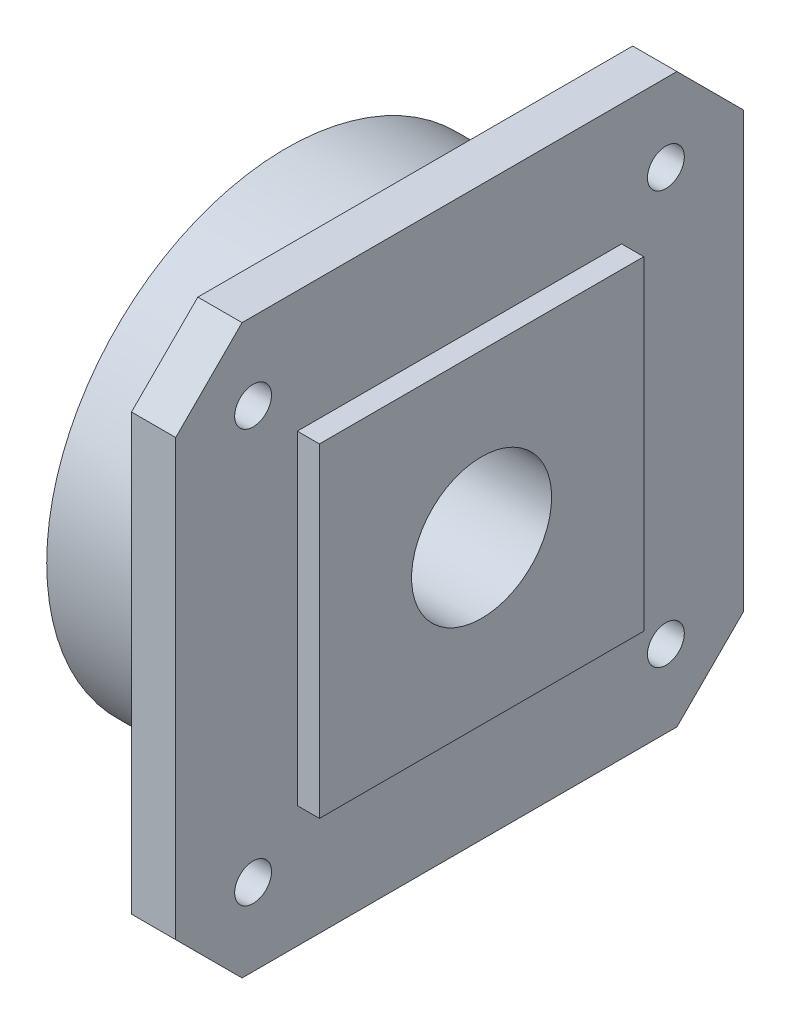
ISO-10303-21;
HEADER;
FILE_DESCRIPTION(('STEP AP214'),'2;1');
FILE_NAME('part.step','',(''),(''),'','','');
FILE_SCHEMA(('AUTOMOTIVE_DESIGN { 1 0 10303 214 1 1 1 1 }'));
ENDSEC;
DATA;
#1=APPLICATION_CONTEXT('core data for automotive mechanical design processes');
#2=APPLICATION_PROTOCOL_DEFINITION('international standard','automotive_design',2000,#1);
#3=PRODUCT_CONTEXT('',#1,'mechanical');
#4=PRODUCT('Part','Part','',(#3));
#5=PRODUCT_RELATED_PRODUCT_CATEGORY('part','',(#4));
#6=PRODUCT_DEFINITION_FORMATION('','',#4);
#7=PRODUCT_DEFINITION_CONTEXT('part definition',#1,'design');
#8=PRODUCT_DEFINITION('design','',#6,#7);
#9=PRODUCT_DEFINITION_SHAPE('','',#8);
#10=(LENGTH_UNIT() NAMED_UNIT(*) SI_UNIT(.MILLI.,.METRE.));
#11=(NAMED_UNIT(*) PLANE_ANGLE_UNIT() SI_UNIT($,.RADIAN.));
#12=(NAMED_UNIT(*) SI_UNIT($,.STERADIAN.) SOLID_ANGLE_UNIT());
#13=UNCERTAINTY_MEASURE_WITH_UNIT(LENGTH_MEASURE(1.E-05),#10,'distance_accuracy_value','');
#14=(GEOMETRIC_REPRESENTATION_CONTEXT(3) GLOBAL_UNCERTAINTY_ASSIGNED_CONTEXT((#13)) GLOBAL_UNIT_ASSIGNED_CONTEXT((#10,
#11,#12)) REPRESENTATION_CONTEXT('',''));
#15=CARTESIAN_POINT('',(0.,0.,0.));
#16=DIRECTION('',(0.,0.,1.));
#17=DIRECTION('',(1.,0.,0.));
#18=AXIS2_PLACEMENT_3D('',#15,#16,#17);
#19=CARTESIAN_POINT('',(-5.5,38.5,-38.5));
#20=DIRECTION('',(-1.,0.,0.));
#21=DIRECTION('',(0.,0.,1.));
#22=AXIS2_PLACEMENT_3D('',#19,#20,#21);
#23=PLANE('',#22);
#24=CARTESIAN_POINT('',(-5.5,38.5,-38.5));
#25=DIRECTION('',(-1.,0.,0.));
#26=DIRECTION('',(0.,0.,1.));
#27=AXIS2_PLACEMENT_3D('',#24,#25,#26);
#28=CIRCLE('',#27,9.5);
#29=CARTESIAN_POINT('',(-5.5,38.5,-29.));
#30=VERTEX_POINT('',#29);
#31=EDGE_CURVE('E36',#30,#30,#28,.F.);
#32=ORIENTED_EDGE('',*,*,#31,.T.);
#33=EDGE_LOOP('',(#32));
#34=FACE_BOUND('',#33,.T.);
#35=CARTESIAN_POINT('',(-5.5,38.5,-38.5));
#36=DIRECTION('',(1.,0.,0.));
#37=DIRECTION('',(0.,0.,-1.));
#38=AXIS2_PLACEMENT_3D('',#35,#36,#37);
#39=CIRCLE('',#38,18.);
#40=CARTESIAN_POINT('',(-5.5,38.5,-56.5));
#41=VERTEX_POINT('',#40);
#42=EDGE_CURVE('E487',#41,#41,#39,.T.);
#43=ORIENTED_EDGE('',*,*,#42,.F.);
#44=EDGE_LOOP('',(#43));
#45=FACE_BOUND('',#44,.T.);
#46=ADVANCED_FACE('F32',(#34,#45),#23,.T.);
#47=CARTESIAN_POINT('',(-17.5,38.5,-38.5));
#48=DIRECTION('',(1.,0.,0.));
#49=DIRECTION('',(0.,0.,-1.));
#50=AXIS2_PLACEMENT_3D('',#47,#48,#49);
#51=CYLINDRICAL_SURFACE('',#50,9.5);
#52=CARTESIAN_POINT('',(9.,38.5,-38.5));
#53=DIRECTION('',(1.,0.,0.));
#54=DIRECTION('',(0.,0.,-1.));
#55=AXIS2_PLACEMENT_3D('',#52,#53,#54);
#56=CIRCLE('',#55,9.5);
#57=CARTESIAN_POINT('',(9.,38.5,-48.));
#58=VERTEX_POINT('',#57);
#59=EDGE_CURVE('E493',#58,#58,#56,.T.);
#60=ORIENTED_EDGE('',*,*,#59,.T.);
#61=EDGE_LOOP('',(#60));
#62=FACE_BOUND('',#61,.T.);
#63=ORIENTED_EDGE('',*,*,#31,.F.);
#64=EDGE_LOOP('',(#63));
#65=FACE_BOUND('',#64,.T.);
#66=ADVANCED_FACE('F252',(#62,#65),#51,.F.);
#67=CARTESIAN_POINT('',(0.,77.,0.));
#68=DIRECTION('',(-1.,0.,0.));
#69=DIRECTION('',(0.,0.,1.));
#70=AXIS2_PLACEMENT_3D('',#67,#68,#69);
#71=PLANE('',#70);
#72=CARTESIAN_POINT('',(0.,10.5,-66.5));
#73=DIRECTION('',(-1.,0.,0.));
#74=DIRECTION('',(0.,0.,1.));
#75=AXIS2_PLACEMENT_3D('',#72,#73,#74);
#76=CIRCLE('',#75,2.5);
#77=CARTESIAN_POINT('',(0.,10.5,-64.));
#78=VERTEX_POINT('',#77);
#79=EDGE_CURVE('E462',#78,#78,#76,.T.);
#80=ORIENTED_EDGE('',*,*,#79,.F.);
#81=EDGE_LOOP('',(#80));
#82=FACE_BOUND('',#81,.T.);
#83=CARTESIAN_POINT('',(0.,10.5,-10.5));
#84=DIRECTION('',(-1.,0.,0.));
#85=DIRECTION('',(0.,0.,1.));
#86=AXIS2_PLACEMENT_3D('',#83,#84,#85);
#87=CIRCLE('',#86,2.5);
#88=CARTESIAN_POINT('',(0.,10.5,-8.));
#89=VERTEX_POINT('',#88);
#90=EDGE_CURVE('E472',#89,#89,#87,.T.);
#91=ORIENTED_EDGE('',*,*,#90,.F.);
#92=EDGE_LOOP('',(#91));
#93=FACE_BOUND('',#92,.T.);
#94=CARTESIAN_POINT('',(0.,66.5,-66.5));
#95=DIRECTION('',(-1.,0.,0.));
#96=DIRECTION('',(0.,0.,1.));
#97=AXIS2_PLACEMENT_3D('',#94,#95,#96);
#98=CIRCLE('',#97,2.5);
#99=CARTESIAN_POINT('',(0.,66.5,-64.));
#100=VERTEX_POINT('',#99);
#101=EDGE_CURVE('E478',#100,#100,#98,.T.);
#102=ORIENTED_EDGE('',*,*,#101,.F.);
#103=EDGE_LOOP('',(#102));
#104=FACE_BOUND('',#103,.T.);
#105=CARTESIAN_POINT('',(0.,66.5,-10.5));
#106=DIRECTION('',(-1.,0.,0.));
#107=DIRECTION('',(0.,0.,1.));
#108=AXIS2_PLACEMENT_3D('',#105,#106,#107);
#109=CIRCLE('',#108,2.5);
#110=CARTESIAN_POINT('',(0.,66.5,-8.));
#111=VERTEX_POINT('',#110);
#112=EDGE_CURVE('E484',#111,#111,#109,.T.);
#113=ORIENTED_EDGE('',*,*,#112,.F.);
#114=EDGE_LOOP('',(#113));
#115=FACE_BOUND('',#114,.T.);
#116=DIRECTION('',(0.,-1.,0.));
#117=VECTOR('',#116,1.);
#118=CARTESIAN_POINT('',(0.,9.,0.));
#119=LINE('',#118,#117);
#120=CARTESIAN_POINT('',(0.,68.,0.));
#121=VERTEX_POINT('',#120);
#122=CARTESIAN_POINT('',(0.,9.,0.));
#123=VERTEX_POINT('',#122);
#124=EDGE_CURVE('E143',#121,#123,#119,.T.);
#125=ORIENTED_EDGE('',*,*,#124,.F.);
#126=DIRECTION('',(0.,-0.707106781186547,0.707106781186548));
#127=VECTOR('',#126,1.);
#128=CARTESIAN_POINT('',(0.,68.,0.));
#129=LINE('',#128,#127);
#130=CARTESIAN_POINT('',(0.,77.,-9.));
#131=VERTEX_POINT('',#130);
#132=EDGE_CURVE('E156',#131,#121,#129,.T.);
#133=ORIENTED_EDGE('',*,*,#132,.F.);
#134=DIRECTION('',(0.,0.,1.));
#135=VECTOR('',#134,1.);
#136=CARTESIAN_POINT('',(0.,77.,-9.));
#137=LINE('',#136,#135);
#138=CARTESIAN_POINT('',(0.,77.,-68.));
#139=VERTEX_POINT('',#138);
#140=EDGE_CURVE('E180',#139,#131,#137,.T.);
#141=ORIENTED_EDGE('',*,*,#140,.F.);
#142=DIRECTION('',(0.,0.707106781186548,0.707106781186548));
#143=VECTOR('',#142,1.);
#144=CARTESIAN_POINT('',(0.,77.,-68.));
#145=LINE('',#144,#143);
#146=CARTESIAN_POINT('',(0.,68.,-77.));
#147=VERTEX_POINT('',#146);
#148=EDGE_CURVE('E178',#147,#139,#145,.T.);
#149=ORIENTED_EDGE('',*,*,#148,.F.);
#150=DIRECTION('',(0.,1.,0.));
#151=VECTOR('',#150,1.);
#152=CARTESIAN_POINT('',(0.,9.,-77.));
#153=LINE('',#152,#151);
#154=CARTESIAN_POINT('',(0.,9.,-77.));
#155=VERTEX_POINT('',#154);
#156=EDGE_CURVE('E176',#155,#147,#153,.T.);
#157=ORIENTED_EDGE('',*,*,#156,.F.);
#158=DIRECTION('',(0.,0.707106781186548,-0.707106781186547));
#159=VECTOR('',#158,1.);
#160=CARTESIAN_POINT('',(0.,0.,-68.));
#161=LINE('',#160,#159);
#162=CARTESIAN_POINT('',(0.,0.,-68.));
#163=VERTEX_POINT('',#162);
#164=EDGE_CURVE('E174',#163,#155,#161,.T.);
#165=ORIENTED_EDGE('',*,*,#164,.F.);
#166=DIRECTION('',(0.,0.,-1.));
#167=VECTOR('',#166,1.);
#168=CARTESIAN_POINT('',(0.,0.,-9.));
#169=LINE('',#168,#167);
#170=CARTESIAN_POINT('',(0.,0.,-9.));
#171=VERTEX_POINT('',#170);
#172=EDGE_CURVE('E172',#171,#163,#169,.T.);
#173=ORIENTED_EDGE('',*,*,#172,.F.);
#174=DIRECTION('',(0.,-0.707106781186547,-0.707106781186547));
#175=VECTOR('',#174,1.);
#176=CARTESIAN_POINT('',(0.,9.,0.));
#177=LINE('',#176,#175);
#178=EDGE_CURVE('E146',#123,#171,#177,.T.);
#179=ORIENTED_EDGE('',*,*,#178,.F.);
#180=EDGE_LOOP('',(#125,#133,#141,#149,#157,#165,#173,#179));
#181=FACE_BOUND('',#180,.T.);
#182=CARTESIAN_POINT('',(0.,38.5,-38.5));
#183=DIRECTION('',(-1.,0.,0.));
#184=DIRECTION('',(0.,0.,1.));
#185=AXIS2_PLACEMENT_3D('',#182,#183,#184);
#186=CIRCLE('',#185,32.5);
#187=CARTESIAN_POINT('',(0.,38.5,-6.00000000000001));
#188=VERTEX_POINT('',#187);
#189=EDGE_CURVE('E496',#188,#188,#186,.T.);
#190=ORIENTED_EDGE('',*,*,#189,.F.);
#191=EDGE_LOOP('',(#190));
#192=FACE_BOUND('',#191,.T.);
#193=ADVANCED_FACE('F211',(#82,#93,#104,#115,#181,#192),#71,.T.);
#194=CARTESIAN_POINT('',(6.,77.,0.));
#195=DIRECTION('',(-1.,0.,0.));
#196=DIRECTION('',(0.,0.,1.));
#197=AXIS2_PLACEMENT_3D('',#194,#195,#196);
#198=PLANE('',#197);
#199=CARTESIAN_POINT('',(6.,10.5,-66.5));
#200=DIRECTION('',(1.,0.,0.));
#201=DIRECTION('',(0.,0.,-1.));
#202=AXIS2_PLACEMENT_3D('',#199,#200,#201);
#203=CIRCLE('',#202,2.5);
#204=CARTESIAN_POINT('',(6.,10.5,-69.));
#205=VERTEX_POINT('',#204);
#206=EDGE_CURVE('E465',#205,#205,#203,.T.);
#207=ORIENTED_EDGE('',*,*,#206,.F.);
#208=EDGE_LOOP('',(#207));
#209=FACE_BOUND('',#208,.T.);
#210=CARTESIAN_POINT('',(6.,10.5,-10.5));
#211=DIRECTION('',(1.,0.,0.));
#212=DIRECTION('',(0.,0.,-1.));
#213=AXIS2_PLACEMENT_3D('',#210,#211,#212);
#214=CIRCLE('',#213,2.5);
#215=CARTESIAN_POINT('',(6.,10.5,-13.));
#216=VERTEX_POINT('',#215);
#217=EDGE_CURVE('E467',#216,#216,#214,.T.);
#218=ORIENTED_EDGE('',*,*,#217,.F.);
#219=EDGE_LOOP('',(#218));
#220=FACE_BOUND('',#219,.T.);
#221=CARTESIAN_POINT('',(6.,66.5,-66.5));
#222=DIRECTION('',(1.,0.,0.));
#223=DIRECTION('',(0.,0.,-1.));
#224=AXIS2_PLACEMENT_3D('',#221,#222,#223);
#225=CIRCLE('',#224,2.5);
#226=CARTESIAN_POINT('',(6.,66.5,-69.));
#227=VERTEX_POINT('',#226);
#228=EDGE_CURVE('E475',#227,#227,#225,.T.);
#229=ORIENTED_EDGE('',*,*,#228,.F.);
#230=EDGE_LOOP('',(#229));
#231=FACE_BOUND('',#230,.T.);
#232=CARTESIAN_POINT('',(6.,66.5,-10.5));
#233=DIRECTION('',(1.,0.,0.));
#234=DIRECTION('',(0.,0.,-1.));
#235=AXIS2_PLACEMENT_3D('',#232,#233,#234);
#236=CIRCLE('',#235,2.5);
#237=CARTESIAN_POINT('',(6.,66.5,-13.));
#238=VERTEX_POINT('',#237);
#239=EDGE_CURVE('E481',#238,#238,#236,.T.);
#240=ORIENTED_EDGE('',*,*,#239,.F.);
#241=EDGE_LOOP('',(#240));
#242=FACE_BOUND('',#241,.T.);
#243=DIRECTION('',(0.,-1.,0.));
#244=VECTOR('',#243,1.);
#245=CARTESIAN_POINT('',(6.,9.,0.));
#246=LINE('',#245,#244);
#247=CARTESIAN_POINT('',(6.,68.,0.));
#248=VERTEX_POINT('',#247);
#249=CARTESIAN_POINT('',(6.,9.,0.));
#250=VERTEX_POINT('',#249);
#251=EDGE_CURVE('E152',#248,#250,#246,.T.);
#252=ORIENTED_EDGE('',*,*,#251,.T.);
#253=DIRECTION('',(0.,-0.707106781186547,-0.707106781186547));
#254=VECTOR('',#253,1.);
#255=CARTESIAN_POINT('',(6.,9.,0.));
#256=LINE('',#255,#254);
#257=CARTESIAN_POINT('',(6.,0.,-9.));
#258=VERTEX_POINT('',#257);
#259=EDGE_CURVE('E155',#250,#258,#256,.T.);
#260=ORIENTED_EDGE('',*,*,#259,.T.);
#261=DIRECTION('',(0.,0.,-1.));
#262=VECTOR('',#261,1.);
#263=CARTESIAN_POINT('',(6.,0.,-9.));
#264=LINE('',#263,#262);
#265=CARTESIAN_POINT('',(6.,0.,-68.));
#266=VERTEX_POINT('',#265);
#267=EDGE_CURVE('E158',#258,#266,#264,.T.);
#268=ORIENTED_EDGE('',*,*,#267,.T.);
#269=DIRECTION('',(0.,0.707106781186548,-0.707106781186547));
#270=VECTOR('',#269,1.);
#271=CARTESIAN_POINT('',(6.,0.,-68.));
#272=LINE('',#271,#270);
#273=CARTESIAN_POINT('',(6.,9.,-77.));
#274=VERTEX_POINT('',#273);
#275=EDGE_CURVE('E160',#266,#274,#272,.T.);
#276=ORIENTED_EDGE('',*,*,#275,.T.);
#277=DIRECTION('',(0.,1.,0.));
#278=VECTOR('',#277,1.);
#279=CARTESIAN_POINT('',(6.,9.,-77.));
#280=LINE('',#279,#278);
#281=CARTESIAN_POINT('',(6.,68.,-77.));
#282=VERTEX_POINT('',#281);
#283=EDGE_CURVE('E162',#274,#282,#280,.T.);
#284=ORIENTED_EDGE('',*,*,#283,.T.);
#285=DIRECTION('',(0.,0.707106781186548,0.707106781186548));
#286=VECTOR('',#285,1.);
#287=CARTESIAN_POINT('',(6.,77.,-68.));
#288=LINE('',#287,#286);
#289=CARTESIAN_POINT('',(6.,77.,-68.));
#290=VERTEX_POINT('',#289);
#291=EDGE_CURVE('E164',#282,#290,#288,.T.);
#292=ORIENTED_EDGE('',*,*,#291,.T.);
#293=DIRECTION('',(0.,0.,1.));
#294=VECTOR('',#293,1.);
#295=CARTESIAN_POINT('',(6.,77.,-9.));
#296=LINE('',#295,#294);
#297=CARTESIAN_POINT('',(6.,77.,-9.));
#298=VERTEX_POINT('',#297);
#299=EDGE_CURVE('E166',#290,#298,#296,.T.);
#300=ORIENTED_EDGE('',*,*,#299,.T.);
#301=DIRECTION('',(0.,-0.707106781186547,0.707106781186548));
#302=VECTOR('',#301,1.);
#303=CARTESIAN_POINT('',(6.,68.,0.));
#304=LINE('',#303,#302);
#305=EDGE_CURVE('E168',#298,#248,#304,.T.);
#306=ORIENTED_EDGE('',*,*,#305,.T.);
#307=EDGE_LOOP('',(#252,#260,#268,#276,#284,#292,#300,#306));
#308=FACE_BOUND('',#307,.T.);
#309=DIRECTION('',(0.,-1.,0.));
#310=VECTOR('',#309,1.);
#311=CARTESIAN_POINT('',(6.,60.5,-16.5));
#312=LINE('',#311,#310);
#313=CARTESIAN_POINT('',(6.,60.5,-16.5));
#314=VERTEX_POINT('',#313);
#315=CARTESIAN_POINT('',(6.,16.5,-16.5));
#316=VERTEX_POINT('',#315);
#317=EDGE_CURVE('E142',#314,#316,#312,.T.);
#318=ORIENTED_EDGE('',*,*,#317,.F.);
#319=DIRECTION('',(0.,0.,1.));
#320=VECTOR('',#319,1.);
#321=CARTESIAN_POINT('',(6.,60.5,-16.5));
#322=LINE('',#321,#320);
#323=CARTESIAN_POINT('',(6.,60.5,-60.5));
#324=VERTEX_POINT('',#323);
#325=EDGE_CURVE('E139',#324,#314,#322,.T.);
#326=ORIENTED_EDGE('',*,*,#325,.F.);
#327=DIRECTION('',(0.,1.,0.));
#328=VECTOR('',#327,1.);
#329=CARTESIAN_POINT('',(6.,60.5,-60.5));
#330=LINE('',#329,#328);
#331=CARTESIAN_POINT('',(6.,16.5,-60.5));
#332=VERTEX_POINT('',#331);
#333=EDGE_CURVE('E53',#332,#324,#330,.T.);
#334=ORIENTED_EDGE('',*,*,#333,.F.);
#335=DIRECTION('',(0.,0.,-1.));
#336=VECTOR('',#335,1.);
#337=CARTESIAN_POINT('',(6.,16.5,-16.5));
#338=LINE('',#337,#336);
#339=EDGE_CURVE('E48',#316,#332,#338,.T.);
#340=ORIENTED_EDGE('',*,*,#339,.F.);
#341=EDGE_LOOP('',(#318,#326,#334,#340));
#342=FACE_BOUND('',#341,.T.);
#343=ADVANCED_FACE('F225',(#209,#220,#231,#242,#308,#342),#198,.F.);
#344=CARTESIAN_POINT('',(6.,9.,0.));
#345=DIRECTION('',(0.,0.,-1.));
#346=DIRECTION('',(-1.,0.,0.));
#347=AXIS2_PLACEMENT_3D('',#344,#345,#346);
#348=PLANE('',#347);
#349=ORIENTED_EDGE('',*,*,#124,.T.);
#350=DIRECTION('',(-1.,0.,0.));
#351=VECTOR('',#350,1.);
#352=CARTESIAN_POINT('',(6.,9.,0.));
#353=LINE('',#352,#351);
#354=EDGE_CURVE('E11',#250,#123,#353,.T.);
#355=ORIENTED_EDGE('',*,*,#354,.F.);
#356=ORIENTED_EDGE('',*,*,#251,.F.);
#357=DIRECTION('',(-1.,0.,0.));
#358=VECTOR('',#357,1.);
#359=CARTESIAN_POINT('',(6.,68.,0.));
#360=LINE('',#359,#358);
#361=EDGE_CURVE('E169',#248,#121,#360,.T.);
#362=ORIENTED_EDGE('',*,*,#361,.T.);
#363=EDGE_LOOP('',(#349,#355,#356,#362));
#364=FACE_BOUND('',#363,.T.);
#365=ADVANCED_FACE('F34',(#364),#348,.F.);
#366=CARTESIAN_POINT('',(6.,9.,0.));
#367=DIRECTION('',(0.,0.707106781186548,-0.707106781186548));
#368=DIRECTION('',(0.,0.707106781186548,0.707106781186548));
#369=AXIS2_PLACEMENT_3D('',#366,#367,#368);
#370=PLANE('',#369);
#371=ORIENTED_EDGE('',*,*,#178,.T.);
#372=DIRECTION('',(-1.,0.,0.));
#373=VECTOR('',#372,1.);
#374=CARTESIAN_POINT('',(6.,0.,-9.));
#375=LINE('',#374,#373);
#376=EDGE_CURVE('E41',#258,#171,#375,.T.);
#377=ORIENTED_EDGE('',*,*,#376,.F.);
#378=ORIENTED_EDGE('',*,*,#259,.F.);
#379=ORIENTED_EDGE('',*,*,#354,.T.);
#380=EDGE_LOOP('',(#371,#377,#378,#379));
#381=FACE_BOUND('',#380,.T.);
#382=ADVANCED_FACE('F229',(#381),#370,.F.);
#383=CARTESIAN_POINT('',(6.,0.,-9.));
#384=DIRECTION('',(0.,1.,0.));
#385=DIRECTION('',(0.,0.,1.));
#386=AXIS2_PLACEMENT_3D('',#383,#384,#385);
#387=PLANE('',#386);
#388=ORIENTED_EDGE('',*,*,#172,.T.);
#389=DIRECTION('',(-1.,0.,0.));
#390=VECTOR('',#389,1.);
#391=CARTESIAN_POINT('',(6.,0.,-68.));
#392=LINE('',#391,#390);
#393=EDGE_CURVE('E197',#266,#163,#392,.T.);
#394=ORIENTED_EDGE('',*,*,#393,.F.);
#395=ORIENTED_EDGE('',*,*,#267,.F.);
#396=ORIENTED_EDGE('',*,*,#376,.T.);
#397=EDGE_LOOP('',(#388,#394,#395,#396));
#398=FACE_BOUND('',#397,.T.);
#399=ADVANCED_FACE('F205',(#398),#387,.F.);
#400=CARTESIAN_POINT('',(6.,0.,-68.));
#401=DIRECTION('',(0.,0.707106781186547,0.707106781186548));
#402=DIRECTION('',(0.,-0.707106781186548,0.707106781186547));
#403=AXIS2_PLACEMENT_3D('',#400,#401,#402);
#404=PLANE('',#403);
#405=ORIENTED_EDGE('',*,*,#164,.T.);
#406=DIRECTION('',(-1.,0.,0.));
#407=VECTOR('',#406,1.);
#408=CARTESIAN_POINT('',(6.,9.,-77.));
#409=LINE('',#408,#407);
#410=EDGE_CURVE('E194',#274,#155,#409,.T.);
#411=ORIENTED_EDGE('',*,*,#410,.F.);
#412=ORIENTED_EDGE('',*,*,#275,.F.);
#413=ORIENTED_EDGE('',*,*,#393,.T.);
#414=EDGE_LOOP('',(#405,#411,#412,#413));
#415=FACE_BOUND('',#414,.T.);
#416=ADVANCED_FACE('F217',(#415),#404,.F.);
#417=CARTESIAN_POINT('',(6.,9.,-77.));
#418=DIRECTION('',(0.,0.,1.));
#419=DIRECTION('',(1.,0.,0.));
#420=AXIS2_PLACEMENT_3D('',#417,#418,#419);
#421=PLANE('',#420);
#422=ORIENTED_EDGE('',*,*,#156,.T.);
#423=DIRECTION('',(-1.,0.,0.));
#424=VECTOR('',#423,1.);
#425=CARTESIAN_POINT('',(6.,68.,-77.));
#426=LINE('',#425,#424);
#427=EDGE_CURVE('E191',#282,#147,#426,.T.);
#428=ORIENTED_EDGE('',*,*,#427,.F.);
#429=ORIENTED_EDGE('',*,*,#283,.F.);
#430=ORIENTED_EDGE('',*,*,#410,.T.);
#431=EDGE_LOOP('',(#422,#428,#429,#430));
#432=FACE_BOUND('',#431,.T.);
#433=ADVANCED_FACE('F221',(#432),#421,.F.);
#434=CARTESIAN_POINT('',(6.,77.,-68.));
#435=DIRECTION('',(0.,-0.707106781186547,0.707106781186547));
#436=DIRECTION('',(0.,-0.707106781186548,-0.707106781186548));
#437=AXIS2_PLACEMENT_3D('',#434,#435,#436);
#438=PLANE('',#437);
#439=ORIENTED_EDGE('',*,*,#148,.T.);
#440=DIRECTION('',(-1.,0.,0.));
#441=VECTOR('',#440,1.);
#442=CARTESIAN_POINT('',(6.,77.,-68.));
#443=LINE('',#442,#441);
#444=EDGE_CURVE('E188',#290,#139,#443,.T.);
#445=ORIENTED_EDGE('',*,*,#444,.F.);
#446=ORIENTED_EDGE('',*,*,#291,.F.);
#447=ORIENTED_EDGE('',*,*,#427,.T.);
#448=EDGE_LOOP('',(#439,#445,#446,#447));
#449=FACE_BOUND('',#448,.T.);
#450=ADVANCED_FACE('F242',(#449),#438,.F.);
#451=CARTESIAN_POINT('',(6.,77.,-9.));
#452=DIRECTION('',(0.,-1.,0.));
#453=DIRECTION('',(0.,0.,-1.));
#454=AXIS2_PLACEMENT_3D('',#451,#452,#453);
#455=PLANE('',#454);
#456=ORIENTED_EDGE('',*,*,#140,.T.);
#457=DIRECTION('',(-1.,0.,0.));
#458=VECTOR('',#457,1.);
#459=CARTESIAN_POINT('',(6.,77.,-9.));
#460=LINE('',#459,#458);
#461=EDGE_CURVE('E185',#298,#131,#460,.T.);
#462=ORIENTED_EDGE('',*,*,#461,.F.);
#463=ORIENTED_EDGE('',*,*,#299,.F.);
#464=ORIENTED_EDGE('',*,*,#444,.T.);
#465=EDGE_LOOP('',(#456,#462,#463,#464));
#466=FACE_BOUND('',#465,.T.);
#467=ADVANCED_FACE('F240',(#466),#455,.F.);
#468=CARTESIAN_POINT('',(6.,68.,0.));
#469=DIRECTION('',(0.,-0.707106781186548,-0.707106781186547));
#470=DIRECTION('',(0.,0.707106781186547,-0.707106781186548));
#471=AXIS2_PLACEMENT_3D('',#468,#469,#470);
#472=PLANE('',#471);
#473=ORIENTED_EDGE('',*,*,#132,.T.);
#474=ORIENTED_EDGE('',*,*,#361,.F.);
#475=ORIENTED_EDGE('',*,*,#305,.F.);
#476=ORIENTED_EDGE('',*,*,#461,.T.);
#477=EDGE_LOOP('',(#473,#474,#475,#476));
#478=FACE_BOUND('',#477,.T.);
#479=ADVANCED_FACE('F235',(#478),#472,.F.);
#480=CARTESIAN_POINT('',(9.,60.5,-16.5));
#481=DIRECTION('',(0.,0.,-1.));
#482=DIRECTION('',(0.,1.,0.));
#483=AXIS2_PLACEMENT_3D('',#480,#481,#482);
#484=PLANE('',#483);
#485=ORIENTED_EDGE('',*,*,#317,.T.);
#486=DIRECTION('',(-1.,0.,0.));
#487=VECTOR('',#486,1.);
#488=CARTESIAN_POINT('',(9.,16.5,-16.5));
#489=LINE('',#488,#487);
#490=CARTESIAN_POINT('',(9.,16.5,-16.5));
#491=VERTEX_POINT('',#490);
#492=EDGE_CURVE('E123',#491,#316,#489,.T.);
#493=ORIENTED_EDGE('',*,*,#492,.F.);
#494=DIRECTION('',(0.,-1.,0.));
#495=VECTOR('',#494,1.);
#496=CARTESIAN_POINT('',(9.,60.5,-16.5));
#497=LINE('',#496,#495);
#498=CARTESIAN_POINT('',(9.,60.5,-16.5));
#499=VERTEX_POINT('',#498);
#500=EDGE_CURVE('E130',#499,#491,#497,.T.);
#501=ORIENTED_EDGE('',*,*,#500,.F.);
#502=DIRECTION('',(-1.,0.,0.));
#503=VECTOR('',#502,1.);
#504=CARTESIAN_POINT('',(9.,60.5,-16.5));
#505=LINE('',#504,#503);
#506=EDGE_CURVE('E504',#499,#314,#505,.T.);
#507=ORIENTED_EDGE('',*,*,#506,.T.);
#508=EDGE_LOOP('',(#485,#493,#501,#507));
#509=FACE_BOUND('',#508,.T.);
#510=ADVANCED_FACE('F141',(#509),#484,.F.);
#511=CARTESIAN_POINT('',(9.,16.5,-16.5));
#512=DIRECTION('',(0.,1.,0.));
#513=DIRECTION('',(0.,0.,1.));
#514=AXIS2_PLACEMENT_3D('',#511,#512,#513);
#515=PLANE('',#514);
#516=ORIENTED_EDGE('',*,*,#339,.T.);
#517=DIRECTION('',(-1.,0.,0.));
#518=VECTOR('',#517,1.);
#519=CARTESIAN_POINT('',(9.,16.5,-60.5));
#520=LINE('',#519,#518);
#521=CARTESIAN_POINT('',(9.,16.5,-60.5));
#522=VERTEX_POINT('',#521);
#523=EDGE_CURVE('E126',#522,#332,#520,.T.);
#524=ORIENTED_EDGE('',*,*,#523,.F.);
#525=DIRECTION('',(0.,0.,-1.));
#526=VECTOR('',#525,1.);
#527=CARTESIAN_POINT('',(9.,16.5,-16.5));
#528=LINE('',#527,#526);
#529=EDGE_CURVE('E119',#491,#522,#528,.T.);
#530=ORIENTED_EDGE('',*,*,#529,.F.);
#531=ORIENTED_EDGE('',*,*,#492,.T.);
#532=EDGE_LOOP('',(#516,#524,#530,#531));
#533=FACE_BOUND('',#532,.T.);
#534=ADVANCED_FACE('F121',(#533),#515,.F.);
#535=CARTESIAN_POINT('',(9.,60.5,-60.5));
#536=DIRECTION('',(0.,0.,1.));
#537=DIRECTION('',(0.,-1.,0.));
#538=AXIS2_PLACEMENT_3D('',#535,#536,#537);
#539=PLANE('',#538);
#540=ORIENTED_EDGE('',*,*,#333,.T.);
#541=DIRECTION('',(-1.,0.,0.));
#542=VECTOR('',#541,1.);
#543=CARTESIAN_POINT('',(9.,60.5,-60.5));
#544=LINE('',#543,#542);
#545=CARTESIAN_POINT('',(9.,60.5,-60.5));
#546=VERTEX_POINT('',#545);
#547=EDGE_CURVE('E148',#546,#324,#544,.T.);
#548=ORIENTED_EDGE('',*,*,#547,.F.);
#549=DIRECTION('',(0.,1.,0.));
#550=VECTOR('',#549,1.);
#551=CARTESIAN_POINT('',(9.,60.5,-60.5));
#552=LINE('',#551,#550);
#553=EDGE_CURVE('E129',#522,#546,#552,.T.);
#554=ORIENTED_EDGE('',*,*,#553,.F.);
#555=ORIENTED_EDGE('',*,*,#523,.T.);
#556=EDGE_LOOP('',(#540,#548,#554,#555));
#557=FACE_BOUND('',#556,.T.);
#558=ADVANCED_FACE('F280',(#557),#539,.F.);
#559=CARTESIAN_POINT('',(9.,60.5,-16.5));
#560=DIRECTION('',(0.,-1.,0.));
#561=DIRECTION('',(0.,0.,-1.));
#562=AXIS2_PLACEMENT_3D('',#559,#560,#561);
#563=PLANE('',#562);
#564=ORIENTED_EDGE('',*,*,#325,.T.);
#565=ORIENTED_EDGE('',*,*,#506,.F.);
#566=DIRECTION('',(0.,0.,1.));
#567=VECTOR('',#566,1.);
#568=CARTESIAN_POINT('',(9.,60.5,-16.5));
#569=LINE('',#568,#567);
#570=EDGE_CURVE('E135',#546,#499,#569,.T.);
#571=ORIENTED_EDGE('',*,*,#570,.F.);
#572=ORIENTED_EDGE('',*,*,#547,.T.);
#573=EDGE_LOOP('',(#564,#565,#571,#572));
#574=FACE_BOUND('',#573,.T.);
#575=ADVANCED_FACE('F276',(#574),#563,.F.);
#576=CARTESIAN_POINT('',(9.,16.5,-16.5));
#577=DIRECTION('',(1.,0.,0.));
#578=DIRECTION('',(0.,0.,-1.));
#579=AXIS2_PLACEMENT_3D('',#576,#577,#578);
#580=PLANE('',#579);
#581=ORIENTED_EDGE('',*,*,#59,.F.);
#582=EDGE_LOOP('',(#581));
#583=FACE_BOUND('',#582,.T.);
#584=ORIENTED_EDGE('',*,*,#500,.T.);
#585=ORIENTED_EDGE('',*,*,#529,.T.);
#586=ORIENTED_EDGE('',*,*,#553,.T.);
#587=ORIENTED_EDGE('',*,*,#570,.T.);
#588=EDGE_LOOP('',(#584,#585,#586,#587));
#589=FACE_BOUND('',#588,.T.);
#590=ADVANCED_FACE('F133',(#583,#589),#580,.T.);
#591=CARTESIAN_POINT('',(-17.5,38.5,-38.5));
#592=DIRECTION('',(1.,0.,0.));
#593=DIRECTION('',(0.,0.,-1.));
#594=AXIS2_PLACEMENT_3D('',#591,#592,#593);
#595=CYLINDRICAL_SURFACE('',#594,32.5);
#596=CARTESIAN_POINT('',(-17.5,38.5,-38.5));
#597=DIRECTION('',(-1.,0.,0.));
#598=DIRECTION('',(0.,0.,1.));
#599=AXIS2_PLACEMENT_3D('',#596,#597,#598);
#600=CIRCLE('',#599,32.5);
#601=CARTESIAN_POINT('',(-17.5,38.5,-6.00000000000001));
#602=VERTEX_POINT('',#601);
#603=EDGE_CURVE('E497',#602,#602,#600,.T.);
#604=ORIENTED_EDGE('',*,*,#603,.F.);
#605=EDGE_LOOP('',(#604));
#606=FACE_BOUND('',#605,.T.);
#607=ORIENTED_EDGE('',*,*,#189,.T.);
#608=EDGE_LOOP('',(#607));
#609=FACE_BOUND('',#608,.T.);
#610=ADVANCED_FACE('F269',(#606,#609),#595,.T.);
#611=CARTESIAN_POINT('',(-17.5,38.5,-38.5));
#612=DIRECTION('',(-1.,0.,0.));
#613=DIRECTION('',(0.,0.,1.));
#614=AXIS2_PLACEMENT_3D('',#611,#612,#613);
#615=PLANE('',#614);
#616=CARTESIAN_POINT('',(-17.5,38.5,-38.5));
#617=DIRECTION('',(-1.,0.,0.));
#618=DIRECTION('',(0.,0.,1.));
#619=AXIS2_PLACEMENT_3D('',#616,#617,#618);
#620=CIRCLE('',#619,21.);
#621=CARTESIAN_POINT('',(-17.5,38.5,-17.5));
#622=VERTEX_POINT('',#621);
#623=EDGE_CURVE('E490',#622,#622,#620,.T.);
#624=ORIENTED_EDGE('',*,*,#623,.F.);
#625=EDGE_LOOP('',(#624));
#626=FACE_BOUND('',#625,.T.);
#627=ORIENTED_EDGE('',*,*,#603,.T.);
#628=EDGE_LOOP('',(#627));
#629=FACE_BOUND('',#628,.T.);
#630=ADVANCED_FACE('F266',(#626,#629),#615,.T.);
#631=CARTESIAN_POINT('',(-5.5,38.5,-38.5));
#632=DIRECTION('',(-1.,0.,0.));
#633=DIRECTION('',(0.,0.,1.));
#634=AXIS2_PLACEMENT_3D('',#631,#632,#633);
#635=CONICAL_SURFACE('',#634,18.,0.244978663126864);
#636=ORIENTED_EDGE('',*,*,#623,.T.);
#637=EDGE_LOOP('',(#636));
#638=FACE_BOUND('',#637,.T.);
#639=ORIENTED_EDGE('',*,*,#42,.T.);
#640=EDGE_LOOP('',(#639));
#641=FACE_BOUND('',#640,.T.);
#642=ADVANCED_FACE('F263',(#638,#641),#635,.F.);
#643=CARTESIAN_POINT('',(-17.5,66.5,-10.5));
#644=DIRECTION('',(1.,0.,0.));
#645=DIRECTION('',(0.,0.,-1.));
#646=AXIS2_PLACEMENT_3D('',#643,#644,#645);
#647=CYLINDRICAL_SURFACE('',#646,2.5);
#648=ORIENTED_EDGE('',*,*,#112,.T.);
#649=EDGE_LOOP('',(#648));
#650=FACE_BOUND('',#649,.T.);
#651=ORIENTED_EDGE('',*,*,#239,.T.);
#652=EDGE_LOOP('',(#651));
#653=FACE_BOUND('',#652,.T.);
#654=ADVANCED_FACE('F335',(#650,#653),#647,.F.);
#655=CARTESIAN_POINT('',(-17.5,66.5,-66.5));
#656=DIRECTION('',(1.,0.,0.));
#657=DIRECTION('',(0.,0.,-1.));
#658=AXIS2_PLACEMENT_3D('',#655,#656,#657);
#659=CYLINDRICAL_SURFACE('',#658,2.5);
#660=ORIENTED_EDGE('',*,*,#101,.T.);
#661=EDGE_LOOP('',(#660));
#662=FACE_BOUND('',#661,.T.);
#663=ORIENTED_EDGE('',*,*,#228,.T.);
#664=EDGE_LOOP('',(#663));
#665=FACE_BOUND('',#664,.T.);
#666=ADVANCED_FACE('F342',(#662,#665),#659,.F.);
#667=CARTESIAN_POINT('',(-17.5,10.5,-10.5));
#668=DIRECTION('',(1.,0.,0.));
#669=DIRECTION('',(0.,0.,-1.));
#670=AXIS2_PLACEMENT_3D('',#667,#668,#669);
#671=CYLINDRICAL_SURFACE('',#670,2.5);
#672=ORIENTED_EDGE('',*,*,#90,.T.);
#673=EDGE_LOOP('',(#672));
#674=FACE_BOUND('',#673,.T.);
#675=ORIENTED_EDGE('',*,*,#217,.T.);
#676=EDGE_LOOP('',(#675));
#677=FACE_BOUND('',#676,.T.);
#678=ADVANCED_FACE('F349',(#674,#677),#671,.F.);
#679=CARTESIAN_POINT('',(-17.5,10.5,-66.5));
#680=DIRECTION('',(1.,0.,0.));
#681=DIRECTION('',(0.,0.,-1.));
#682=AXIS2_PLACEMENT_3D('',#679,#680,#681);
#683=CYLINDRICAL_SURFACE('',#682,2.5);
#684=ORIENTED_EDGE('',*,*,#79,.T.);
#685=EDGE_LOOP('',(#684));
#686=FACE_BOUND('',#685,.T.);
#687=ORIENTED_EDGE('',*,*,#206,.T.);
#688=EDGE_LOOP('',(#687));
#689=FACE_BOUND('',#688,.T.);
#690=ADVANCED_FACE('F358',(#686,#689),#683,.F.);
#691=CLOSED_SHELL('',(#46,#66,#193,#343,#365,#382,#399,#416,#433,#450,#467,#479,#510,#534,#558,
#575,#590,#610,#630,#642,#654,#666,#678,#690));
#692=MANIFOLD_SOLID_BREP('B2',#691);
#693=ADVANCED_BREP_SHAPE_REPRESENTATION('',(#18,#692),#14);
#694=SHAPE_DEFINITION_REPRESENTATION(#9,#693);
ENDSEC;
END-ISO-10303-21;
